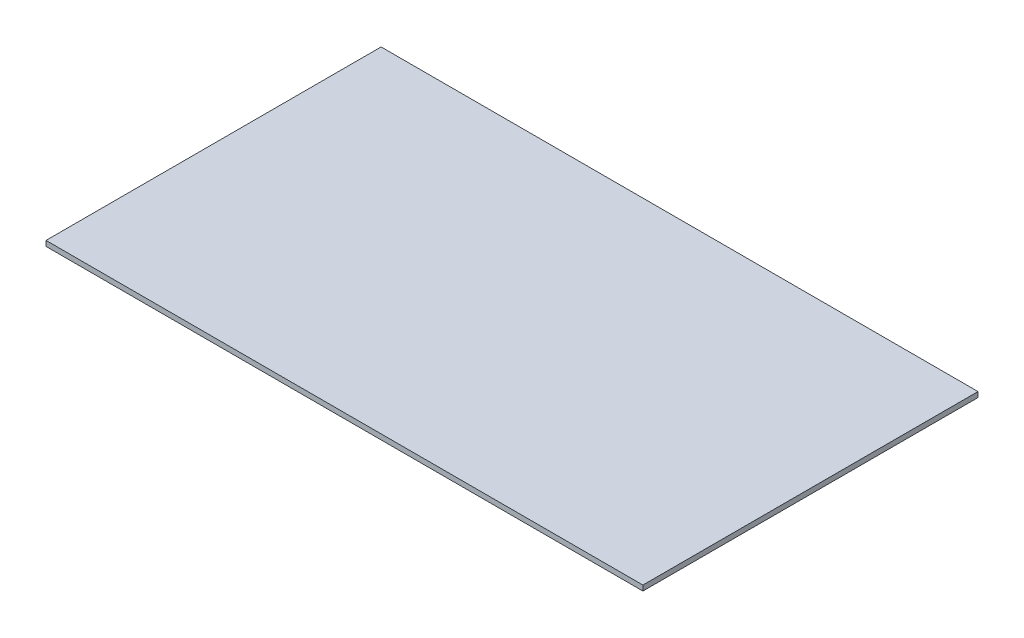
ISO-10303-21;
HEADER;
FILE_DESCRIPTION(('STEP AP214'),'2;1');
FILE_NAME('part.step','',(''),(''),'','','');
FILE_SCHEMA(('AUTOMOTIVE_DESIGN { 1 0 10303 214 1 1 1 1 }'));
ENDSEC;
DATA;
#1=APPLICATION_CONTEXT('core data for automotive mechanical design processes');
#2=APPLICATION_PROTOCOL_DEFINITION('international standard','automotive_design',2000,#1);
#3=PRODUCT_CONTEXT('',#1,'mechanical');
#4=PRODUCT('Part','Part','',(#3));
#5=PRODUCT_RELATED_PRODUCT_CATEGORY('part','',(#4));
#6=PRODUCT_DEFINITION_FORMATION('','',#4);
#7=PRODUCT_DEFINITION_CONTEXT('part definition',#1,'design');
#8=PRODUCT_DEFINITION('design','',#6,#7);
#9=PRODUCT_DEFINITION_SHAPE('','',#8);
#10=(LENGTH_UNIT() NAMED_UNIT(*) SI_UNIT(.MILLI.,.METRE.));
#11=(NAMED_UNIT(*) PLANE_ANGLE_UNIT() SI_UNIT($,.RADIAN.));
#12=(NAMED_UNIT(*) SI_UNIT($,.STERADIAN.) SOLID_ANGLE_UNIT());
#13=UNCERTAINTY_MEASURE_WITH_UNIT(LENGTH_MEASURE(1.E-05),#10,'distance_accuracy_value','');
#14=(GEOMETRIC_REPRESENTATION_CONTEXT(3) GLOBAL_UNCERTAINTY_ASSIGNED_CONTEXT((#13)) GLOBAL_UNIT_ASSIGNED_CONTEXT((#10,
#11,#12)) REPRESENTATION_CONTEXT('',''));
#15=CARTESIAN_POINT('',(0.,0.,0.));
#16=DIRECTION('',(0.,0.,1.));
#17=DIRECTION('',(1.,0.,0.));
#18=AXIS2_PLACEMENT_3D('',#15,#16,#17);
#19=CARTESIAN_POINT('',(0.,4.7625,0.));
#20=DIRECTION('',(1.,0.,0.));
#21=DIRECTION('',(0.,0.,-1.));
#22=AXIS2_PLACEMENT_3D('',#19,#20,#21);
#23=PLANE('',#22);
#24=DIRECTION('',(0.,0.,1.));
#25=VECTOR('',#24,1.);
#26=CARTESIAN_POINT('',(0.,0.,0.));
#27=LINE('',#26,#25);
#28=CARTESIAN_POINT('',(0.,0.,0.));
#29=VERTEX_POINT('',#28);
#30=CARTESIAN_POINT('',(1.15928056980147E-13,0.,304.8));
#31=VERTEX_POINT('',#30);
#32=EDGE_CURVE('E96',#29,#31,#27,.T.);
#33=ORIENTED_EDGE('',*,*,#32,.T.);
#34=DIRECTION('',(0.,-1.,0.));
#35=VECTOR('',#34,1.);
#36=CARTESIAN_POINT('',(1.15928056980147E-13,4.7625,304.8));
#37=LINE('',#36,#35);
#38=CARTESIAN_POINT('',(1.15928056980147E-13,4.7625,304.8));
#39=VERTEX_POINT('',#38);
#40=EDGE_CURVE('E11',#39,#31,#37,.T.);
#41=ORIENTED_EDGE('',*,*,#40,.F.);
#42=DIRECTION('',(0.,0.,1.));
#43=VECTOR('',#42,1.);
#44=CARTESIAN_POINT('',(0.,4.7625,0.));
#45=LINE('',#44,#43);
#46=CARTESIAN_POINT('',(0.,4.7625,0.));
#47=VERTEX_POINT('',#46);
#48=EDGE_CURVE('E82',#47,#39,#45,.T.);
#49=ORIENTED_EDGE('',*,*,#48,.F.);
#50=DIRECTION('',(0.,-1.,0.));
#51=VECTOR('',#50,1.);
#52=CARTESIAN_POINT('',(0.,4.7625,0.));
#53=LINE('',#52,#51);
#54=EDGE_CURVE('E49',#47,#29,#53,.T.);
#55=ORIENTED_EDGE('',*,*,#54,.T.);
#56=EDGE_LOOP('',(#33,#41,#49,#55));
#57=FACE_BOUND('',#56,.T.);
#58=ADVANCED_FACE('F33',(#57),#23,.F.);
#59=CARTESIAN_POINT('',(1.15928056980147E-13,4.7625,304.8));
#60=DIRECTION('',(0.,0.,-1.));
#61=DIRECTION('',(-1.,0.,0.));
#62=AXIS2_PLACEMENT_3D('',#59,#60,#61);
#63=PLANE('',#62);
#64=DIRECTION('',(1.,0.,0.));
#65=VECTOR('',#64,1.);
#66=CARTESIAN_POINT('',(1.15928056980147E-13,0.,304.8));
#67=LINE('',#66,#65);
#68=CARTESIAN_POINT('',(542.925,0.,304.8));
#69=VERTEX_POINT('',#68);
#70=EDGE_CURVE('E87',#31,#69,#67,.T.);
#71=ORIENTED_EDGE('',*,*,#70,.T.);
#72=DIRECTION('',(0.,-1.,0.));
#73=VECTOR('',#72,1.);
#74=CARTESIAN_POINT('',(542.925,4.7625,304.8));
#75=LINE('',#74,#73);
#76=CARTESIAN_POINT('',(542.925,4.7625,304.8));
#77=VERTEX_POINT('',#76);
#78=EDGE_CURVE('E41',#77,#69,#75,.T.);
#79=ORIENTED_EDGE('',*,*,#78,.F.);
#80=DIRECTION('',(1.,0.,0.));
#81=VECTOR('',#80,1.);
#82=CARTESIAN_POINT('',(1.15928056980147E-13,4.7625,304.8));
#83=LINE('',#82,#81);
#84=EDGE_CURVE('E74',#39,#77,#83,.T.);
#85=ORIENTED_EDGE('',*,*,#84,.F.);
#86=ORIENTED_EDGE('',*,*,#40,.T.);
#87=EDGE_LOOP('',(#71,#79,#85,#86));
#88=FACE_BOUND('',#87,.T.);
#89=ADVANCED_FACE('F86',(#88),#63,.F.);
#90=CARTESIAN_POINT('',(542.925,4.7625,0.));
#91=DIRECTION('',(1.,0.,0.));
#92=DIRECTION('',(0.,0.,-1.));
#93=AXIS2_PLACEMENT_3D('',#90,#91,#92);
#94=PLANE('',#93);
#95=DIRECTION('',(0.,0.,1.));
#96=VECTOR('',#95,1.);
#97=CARTESIAN_POINT('',(542.925,0.,0.));
#98=LINE('',#97,#96);
#99=CARTESIAN_POINT('',(542.925,0.,0.));
#100=VERTEX_POINT('',#99);
#101=EDGE_CURVE('E99',#100,#69,#98,.T.);
#102=ORIENTED_EDGE('',*,*,#101,.F.);
#103=DIRECTION('',(0.,-1.,0.));
#104=VECTOR('',#103,1.);
#105=CARTESIAN_POINT('',(542.925,4.7625,0.));
#106=LINE('',#105,#104);
#107=CARTESIAN_POINT('',(542.925,4.7625,0.));
#108=VERTEX_POINT('',#107);
#109=EDGE_CURVE('E63',#108,#100,#106,.T.);
#110=ORIENTED_EDGE('',*,*,#109,.F.);
#111=DIRECTION('',(0.,0.,1.));
#112=VECTOR('',#111,1.);
#113=CARTESIAN_POINT('',(542.925,4.7625,0.));
#114=LINE('',#113,#112);
#115=EDGE_CURVE('E81',#108,#77,#114,.T.);
#116=ORIENTED_EDGE('',*,*,#115,.T.);
#117=ORIENTED_EDGE('',*,*,#78,.T.);
#118=EDGE_LOOP('',(#102,#110,#116,#117));
#119=FACE_BOUND('',#118,.T.);
#120=ADVANCED_FACE('F90',(#119),#94,.T.);
#121=CARTESIAN_POINT('',(0.,4.7625,0.));
#122=DIRECTION('',(0.,0.,-1.));
#123=DIRECTION('',(-1.,0.,0.));
#124=AXIS2_PLACEMENT_3D('',#121,#122,#123);
#125=PLANE('',#124);
#126=DIRECTION('',(1.,0.,0.));
#127=VECTOR('',#126,1.);
#128=CARTESIAN_POINT('',(0.,0.,0.));
#129=LINE('',#128,#127);
#130=EDGE_CURVE('E101',#29,#100,#129,.T.);
#131=ORIENTED_EDGE('',*,*,#130,.F.);
#132=ORIENTED_EDGE('',*,*,#54,.F.);
#133=DIRECTION('',(1.,0.,0.));
#134=VECTOR('',#133,1.);
#135=CARTESIAN_POINT('',(0.,4.7625,0.));
#136=LINE('',#135,#134);
#137=EDGE_CURVE('E91',#47,#108,#136,.T.);
#138=ORIENTED_EDGE('',*,*,#137,.T.);
#139=ORIENTED_EDGE('',*,*,#109,.T.);
#140=EDGE_LOOP('',(#131,#132,#138,#139));
#141=FACE_BOUND('',#140,.T.);
#142=ADVANCED_FACE('F107',(#141),#125,.T.);
#143=CARTESIAN_POINT('',(0.,4.7625,0.));
#144=DIRECTION('',(0.,1.,0.));
#145=DIRECTION('',(0.,0.,1.));
#146=AXIS2_PLACEMENT_3D('',#143,#144,#145);
#147=PLANE('',#146);
#148=ORIENTED_EDGE('',*,*,#48,.T.);
#149=ORIENTED_EDGE('',*,*,#84,.T.);
#150=ORIENTED_EDGE('',*,*,#115,.F.);
#151=ORIENTED_EDGE('',*,*,#137,.F.);
#152=EDGE_LOOP('',(#148,#149,#150,#151));
#153=FACE_BOUND('',#152,.T.);
#154=ADVANCED_FACE('F78',(#153),#147,.T.);
#155=CARTESIAN_POINT('',(0.,0.,0.));
#156=DIRECTION('',(0.,1.,0.));
#157=DIRECTION('',(0.,0.,1.));
#158=AXIS2_PLACEMENT_3D('',#155,#156,#157);
#159=PLANE('',#158);
#160=ORIENTED_EDGE('',*,*,#32,.F.);
#161=ORIENTED_EDGE('',*,*,#130,.T.);
#162=ORIENTED_EDGE('',*,*,#101,.T.);
#163=ORIENTED_EDGE('',*,*,#70,.F.);
#164=EDGE_LOOP('',(#160,#161,#162,#163));
#165=FACE_BOUND('',#164,.T.);
#166=ADVANCED_FACE('F106',(#165),#159,.F.);
#167=CLOSED_SHELL('',(#58,#89,#120,#142,#154,#166));
#168=MANIFOLD_SOLID_BREP('B2',#167);
#169=ADVANCED_BREP_SHAPE_REPRESENTATION('',(#18,#168),#14);
#170=SHAPE_DEFINITION_REPRESENTATION(#9,#169);
ENDSEC;
END-ISO-10303-21;
